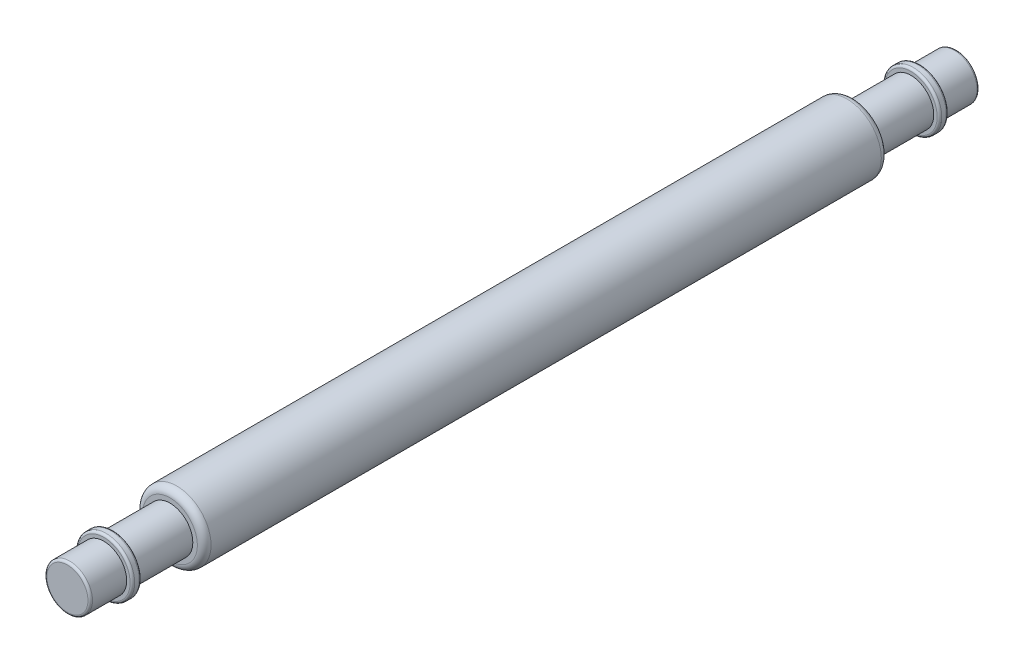
ISO-10303-21;
HEADER;
FILE_DESCRIPTION(('STEP AP214'),'2;1');
FILE_NAME('part.step','',(''),(''),'','','');
FILE_SCHEMA(('AUTOMOTIVE_DESIGN { 1 0 10303 214 1 1 1 1 }'));
ENDSEC;
DATA;
#1=APPLICATION_CONTEXT('core data for automotive mechanical design processes');
#2=APPLICATION_PROTOCOL_DEFINITION('international standard','automotive_design',2000,#1);
#3=PRODUCT_CONTEXT('',#1,'mechanical');
#4=PRODUCT('Part','Part','',(#3));
#5=PRODUCT_RELATED_PRODUCT_CATEGORY('part','',(#4));
#6=PRODUCT_DEFINITION_FORMATION('','',#4);
#7=PRODUCT_DEFINITION_CONTEXT('part definition',#1,'design');
#8=PRODUCT_DEFINITION('design','',#6,#7);
#9=PRODUCT_DEFINITION_SHAPE('','',#8);
#10=(LENGTH_UNIT() NAMED_UNIT(*) SI_UNIT(.MILLI.,.METRE.));
#11=(NAMED_UNIT(*) PLANE_ANGLE_UNIT() SI_UNIT($,.RADIAN.));
#12=(NAMED_UNIT(*) SI_UNIT($,.STERADIAN.) SOLID_ANGLE_UNIT());
#13=UNCERTAINTY_MEASURE_WITH_UNIT(LENGTH_MEASURE(1.E-05),#10,'distance_accuracy_value','');
#14=(GEOMETRIC_REPRESENTATION_CONTEXT(3) GLOBAL_UNCERTAINTY_ASSIGNED_CONTEXT((#13)) GLOBAL_UNIT_ASSIGNED_CONTEXT((#10,
#11,#12)) REPRESENTATION_CONTEXT('',''));
#15=CARTESIAN_POINT('',(0.,0.,0.));
#16=DIRECTION('',(0.,0.,1.));
#17=DIRECTION('',(1.,0.,0.));
#18=AXIS2_PLACEMENT_3D('',#15,#16,#17);
#19=CARTESIAN_POINT('',(0.,0.,9.75));
#20=DIRECTION('',(0.,0.,-1.));
#21=DIRECTION('',(-1.,0.,0.));
#22=AXIS2_PLACEMENT_3D('',#19,#20,#21);
#23=CYLINDRICAL_SURFACE('',#22,0.5);
#24=CARTESIAN_POINT('',(0.,0.,-7.5));
#25=DIRECTION('',(0.,0.,1.));
#26=DIRECTION('',(1.,0.,0.));
#27=AXIS2_PLACEMENT_3D('',#24,#25,#26);
#28=CIRCLE('',#27,0.5);
#29=CARTESIAN_POINT('',(0.5,0.,-7.5));
#30=VERTEX_POINT('',#29);
#31=EDGE_CURVE('E114',#30,#30,#28,.F.);
#32=ORIENTED_EDGE('',*,*,#31,.T.);
#33=EDGE_LOOP('',(#32));
#34=FACE_BOUND('',#33,.T.);
#35=CARTESIAN_POINT('',(0.,0.,-8.75));
#36=DIRECTION('',(0.,0.,-1.));
#37=DIRECTION('',(-1.,0.,0.));
#38=AXIS2_PLACEMENT_3D('',#35,#36,#37);
#39=CIRCLE('',#38,0.5);
#40=CARTESIAN_POINT('',(-0.5,0.,-8.75));
#41=VERTEX_POINT('',#40);
#42=EDGE_CURVE('E55',#41,#41,#39,.T.);
#43=ORIENTED_EDGE('',*,*,#42,.F.);
#44=EDGE_LOOP('',(#43));
#45=FACE_BOUND('',#44,.T.);
#46=ADVANCED_FACE('F35',(#34,#45),#23,.T.);
#47=CARTESIAN_POINT('',(0.,0.,7.5));
#48=DIRECTION('',(0.,0.,1.));
#49=DIRECTION('',(1.,0.,0.));
#50=AXIS2_PLACEMENT_3D('',#47,#48,#49);
#51=CIRCLE('',#50,0.5);
#52=CARTESIAN_POINT('',(0.5,0.,7.5));
#53=VERTEX_POINT('',#52);
#54=EDGE_CURVE('E86',#53,#53,#51,.F.);
#55=ORIENTED_EDGE('',*,*,#54,.F.);
#56=EDGE_LOOP('',(#55));
#57=FACE_BOUND('',#56,.T.);
#58=CARTESIAN_POINT('',(0.,0.,8.75));
#59=DIRECTION('',(0.,0.,1.));
#60=DIRECTION('',(1.,0.,0.));
#61=AXIS2_PLACEMENT_3D('',#58,#59,#60);
#62=CIRCLE('',#61,0.5);
#63=CARTESIAN_POINT('',(0.5,0.,8.75));
#64=VERTEX_POINT('',#63);
#65=EDGE_CURVE('E78',#64,#64,#62,.T.);
#66=ORIENTED_EDGE('',*,*,#65,.F.);
#67=EDGE_LOOP('',(#66));
#68=FACE_BOUND('',#67,.T.);
#69=ADVANCED_FACE('F123',(#57,#68),#23,.T.);
#70=CARTESIAN_POINT('',(0.,0.,7.5));
#71=DIRECTION('',(0.,0.,1.));
#72=DIRECTION('',(1.,0.,0.));
#73=AXIS2_PLACEMENT_3D('',#70,#71,#72);
#74=PLANE('',#73);
#75=CARTESIAN_POINT('',(0.,0.,7.5));
#76=DIRECTION('',(0.,0.,1.));
#77=DIRECTION('',(1.,0.,0.));
#78=AXIS2_PLACEMENT_3D('',#75,#76,#77);
#79=CIRCLE('',#78,0.600000000000001);
#80=CARTESIAN_POINT('',(0.600000000000001,0.,7.5));
#81=VERTEX_POINT('',#80);
#82=EDGE_CURVE('E110',#81,#81,#79,.T.);
#83=ORIENTED_EDGE('',*,*,#82,.T.);
#84=EDGE_LOOP('',(#83));
#85=FACE_BOUND('',#84,.T.);
#86=ORIENTED_EDGE('',*,*,#54,.T.);
#87=EDGE_LOOP('',(#86));
#88=FACE_BOUND('',#87,.T.);
#89=ADVANCED_FACE('F121',(#85,#88),#74,.T.);
#90=CARTESIAN_POINT('',(0.,0.,-7.5));
#91=DIRECTION('',(0.,0.,1.));
#92=DIRECTION('',(1.,0.,0.));
#93=AXIS2_PLACEMENT_3D('',#90,#91,#92);
#94=PLANE('',#93);
#95=CARTESIAN_POINT('',(0.,0.,-7.5));
#96=DIRECTION('',(0.,0.,1.));
#97=DIRECTION('',(1.,0.,0.));
#98=AXIS2_PLACEMENT_3D('',#95,#96,#97);
#99=CIRCLE('',#98,0.600000000000001);
#100=CARTESIAN_POINT('',(0.600000000000001,0.,-7.5));
#101=VERTEX_POINT('',#100);
#102=EDGE_CURVE('E100',#101,#101,#99,.F.);
#103=ORIENTED_EDGE('',*,*,#102,.T.);
#104=EDGE_LOOP('',(#103));
#105=FACE_BOUND('',#104,.T.);
#106=ORIENTED_EDGE('',*,*,#31,.F.);
#107=EDGE_LOOP('',(#106));
#108=FACE_BOUND('',#107,.T.);
#109=ADVANCED_FACE('F216',(#105,#108),#94,.F.);
#110=CARTESIAN_POINT('',(0.,0.,7.5));
#111=DIRECTION('',(0.,0.,-1.));
#112=DIRECTION('',(-1.,0.,0.));
#113=AXIS2_PLACEMENT_3D('',#110,#111,#112);
#114=CYLINDRICAL_SURFACE('',#113,0.750000000000001);
#115=CARTESIAN_POINT('',(0.,0.,7.35));
#116=DIRECTION('',(0.,0.,1.));
#117=DIRECTION('',(1.,0.,0.));
#118=AXIS2_PLACEMENT_3D('',#115,#116,#117);
#119=CIRCLE('',#118,0.750000000000001);
#120=CARTESIAN_POINT('',(0.750000000000001,0.,7.35));
#121=VERTEX_POINT('',#120);
#122=EDGE_CURVE('E103',#121,#121,#119,.F.);
#123=ORIENTED_EDGE('',*,*,#122,.T.);
#124=EDGE_LOOP('',(#123));
#125=FACE_BOUND('',#124,.T.);
#126=CARTESIAN_POINT('',(0.,0.,-7.35));
#127=DIRECTION('',(0.,0.,1.));
#128=DIRECTION('',(1.,0.,0.));
#129=AXIS2_PLACEMENT_3D('',#126,#127,#128);
#130=CIRCLE('',#129,0.750000000000001);
#131=CARTESIAN_POINT('',(0.750000000000001,0.,-7.35));
#132=VERTEX_POINT('',#131);
#133=EDGE_CURVE('E107',#132,#132,#130,.T.);
#134=ORIENTED_EDGE('',*,*,#133,.T.);
#135=EDGE_LOOP('',(#134));
#136=FACE_BOUND('',#135,.T.);
#137=ADVANCED_FACE('F212',(#125,#136),#114,.T.);
#138=CARTESIAN_POINT('',(0.,0.,7.35));
#139=DIRECTION('',(0.,0.,1.));
#140=DIRECTION('',(1.,0.,0.));
#141=AXIS2_PLACEMENT_3D('',#138,#139,#140);
#142=TOROIDAL_SURFACE('',#141,0.600000000000001,0.15);
#143=ORIENTED_EDGE('',*,*,#122,.F.);
#144=EDGE_LOOP('',(#143));
#145=FACE_BOUND('',#144,.T.);
#146=ORIENTED_EDGE('',*,*,#82,.F.);
#147=EDGE_LOOP('',(#146));
#148=FACE_BOUND('',#147,.T.);
#149=ADVANCED_FACE('F143',(#145,#148),#142,.T.);
#150=CARTESIAN_POINT('',(0.,0.,-7.35));
#151=DIRECTION('',(0.,0.,1.));
#152=DIRECTION('',(1.,0.,0.));
#153=AXIS2_PLACEMENT_3D('',#150,#151,#152);
#154=TOROIDAL_SURFACE('',#153,0.600000000000001,0.15);
#155=ORIENTED_EDGE('',*,*,#102,.F.);
#156=EDGE_LOOP('',(#155));
#157=FACE_BOUND('',#156,.T.);
#158=ORIENTED_EDGE('',*,*,#133,.F.);
#159=EDGE_LOOP('',(#158));
#160=FACE_BOUND('',#159,.T.);
#161=ADVANCED_FACE('F133',(#157,#160),#154,.T.);
#162=CARTESIAN_POINT('',(0.,0.,8.75));
#163=DIRECTION('',(0.,0.,1.));
#164=DIRECTION('',(1.,0.,0.));
#165=AXIS2_PLACEMENT_3D('',#162,#163,#164);
#166=PLANE('',#165);
#167=CARTESIAN_POINT('',(0.,0.,8.75));
#168=DIRECTION('',(0.,0.,1.));
#169=DIRECTION('',(1.,0.,0.));
#170=AXIS2_PLACEMENT_3D('',#167,#168,#169);
#171=CIRCLE('',#170,0.575);
#172=CARTESIAN_POINT('',(0.575,0.,8.75));
#173=VERTEX_POINT('',#172);
#174=EDGE_CURVE('E58',#173,#173,#171,.F.);
#175=ORIENTED_EDGE('',*,*,#174,.T.);
#176=EDGE_LOOP('',(#175));
#177=FACE_BOUND('',#176,.T.);
#178=ORIENTED_EDGE('',*,*,#65,.T.);
#179=EDGE_LOOP('',(#178));
#180=FACE_BOUND('',#179,.T.);
#181=ADVANCED_FACE('F130',(#177,#180),#166,.F.);
#182=CARTESIAN_POINT('',(0.,0.,8.95));
#183=DIRECTION('',(0.,0.,1.));
#184=DIRECTION('',(1.,0.,0.));
#185=AXIS2_PLACEMENT_3D('',#182,#183,#184);
#186=PLANE('',#185);
#187=CARTESIAN_POINT('',(0.,0.,8.95));
#188=DIRECTION('',(0.,0.,1.));
#189=DIRECTION('',(1.,0.,0.));
#190=AXIS2_PLACEMENT_3D('',#187,#188,#189);
#191=CIRCLE('',#190,0.575);
#192=CARTESIAN_POINT('',(0.575,0.,8.95));
#193=VERTEX_POINT('',#192);
#194=EDGE_CURVE('E74',#193,#193,#191,.T.);
#195=ORIENTED_EDGE('',*,*,#194,.T.);
#196=EDGE_LOOP('',(#195));
#197=FACE_BOUND('',#196,.T.);
#198=CARTESIAN_POINT('',(0.,0.,8.95));
#199=DIRECTION('',(0.,0.,1.));
#200=DIRECTION('',(1.,0.,0.));
#201=AXIS2_PLACEMENT_3D('',#198,#199,#200);
#202=CIRCLE('',#201,0.5);
#203=CARTESIAN_POINT('',(0.5,0.,8.95));
#204=VERTEX_POINT('',#203);
#205=EDGE_CURVE('E62',#204,#204,#202,.T.);
#206=ORIENTED_EDGE('',*,*,#205,.F.);
#207=EDGE_LOOP('',(#206));
#208=FACE_BOUND('',#207,.T.);
#209=ADVANCED_FACE('F132',(#197,#208),#186,.T.);
#210=CARTESIAN_POINT('',(0.,0.,8.75));
#211=DIRECTION('',(0.,0.,1.));
#212=DIRECTION('',(1.,0.,0.));
#213=AXIS2_PLACEMENT_3D('',#210,#211,#212);
#214=CYLINDRICAL_SURFACE('',#213,0.625);
#215=CARTESIAN_POINT('',(0.,0.,8.9));
#216=DIRECTION('',(0.,0.,1.));
#217=DIRECTION('',(1.,0.,0.));
#218=AXIS2_PLACEMENT_3D('',#215,#216,#217);
#219=CIRCLE('',#218,0.625);
#220=CARTESIAN_POINT('',(0.625,0.,8.9));
#221=VERTEX_POINT('',#220);
#222=EDGE_CURVE('E66',#221,#221,#219,.F.);
#223=ORIENTED_EDGE('',*,*,#222,.T.);
#224=EDGE_LOOP('',(#223));
#225=FACE_BOUND('',#224,.T.);
#226=CARTESIAN_POINT('',(0.,0.,8.8));
#227=DIRECTION('',(0.,0.,1.));
#228=DIRECTION('',(1.,0.,0.));
#229=AXIS2_PLACEMENT_3D('',#226,#227,#228);
#230=CIRCLE('',#229,0.625);
#231=CARTESIAN_POINT('',(0.625,0.,8.8));
#232=VERTEX_POINT('',#231);
#233=EDGE_CURVE('E70',#232,#232,#230,.T.);
#234=ORIENTED_EDGE('',*,*,#233,.T.);
#235=EDGE_LOOP('',(#234));
#236=FACE_BOUND('',#235,.T.);
#237=ADVANCED_FACE('F140',(#225,#236),#214,.T.);
#238=CARTESIAN_POINT('',(0.,0.,9.75));
#239=DIRECTION('',(0.,0.,1.));
#240=DIRECTION('',(1.,0.,0.));
#241=AXIS2_PLACEMENT_3D('',#238,#239,#240);
#242=PLANE('',#241);
#243=CARTESIAN_POINT('',(0.,0.,9.75));
#244=DIRECTION('',(0.,0.,1.));
#245=DIRECTION('',(1.,0.,0.));
#246=AXIS2_PLACEMENT_3D('',#243,#244,#245);
#247=CIRCLE('',#246,0.45);
#248=CARTESIAN_POINT('',(0.45,0.,9.75));
#249=VERTEX_POINT('',#248);
#250=EDGE_CURVE('E96',#249,#249,#247,.T.);
#251=ORIENTED_EDGE('',*,*,#250,.T.);
#252=EDGE_LOOP('',(#251));
#253=FACE_BOUND('',#252,.T.);
#254=ADVANCED_FACE('F166',(#253),#242,.T.);
#255=CARTESIAN_POINT('',(0.,0.,9.7));
#256=DIRECTION('',(0.,0.,1.));
#257=DIRECTION('',(1.,0.,0.));
#258=AXIS2_PLACEMENT_3D('',#255,#256,#257);
#259=TOROIDAL_SURFACE('',#258,0.45,0.05);
#260=CARTESIAN_POINT('',(0.,0.,9.7));
#261=DIRECTION('',(0.,0.,1.));
#262=DIRECTION('',(1.,0.,0.));
#263=AXIS2_PLACEMENT_3D('',#260,#261,#262);
#264=CIRCLE('',#263,0.5);
#265=CARTESIAN_POINT('',(0.5,0.,9.7));
#266=VERTEX_POINT('',#265);
#267=EDGE_CURVE('E92',#266,#266,#264,.F.);
#268=ORIENTED_EDGE('',*,*,#267,.F.);
#269=EDGE_LOOP('',(#268));
#270=FACE_BOUND('',#269,.T.);
#271=ORIENTED_EDGE('',*,*,#250,.F.);
#272=EDGE_LOOP('',(#271));
#273=FACE_BOUND('',#272,.T.);
#274=ADVANCED_FACE('F157',(#270,#273),#259,.T.);
#275=ORIENTED_EDGE('',*,*,#205,.T.);
#276=EDGE_LOOP('',(#275));
#277=FACE_BOUND('',#276,.T.);
#278=ORIENTED_EDGE('',*,*,#267,.T.);
#279=EDGE_LOOP('',(#278));
#280=FACE_BOUND('',#279,.T.);
#281=ADVANCED_FACE('F149',(#277,#280),#23,.T.);
#282=CARTESIAN_POINT('',(0.,0.,8.9));
#283=DIRECTION('',(0.,0.,1.));
#284=DIRECTION('',(1.,0.,0.));
#285=AXIS2_PLACEMENT_3D('',#282,#283,#284);
#286=TOROIDAL_SURFACE('',#285,0.575,0.05);
#287=ORIENTED_EDGE('',*,*,#222,.F.);
#288=EDGE_LOOP('',(#287));
#289=FACE_BOUND('',#288,.T.);
#290=ORIENTED_EDGE('',*,*,#194,.F.);
#291=EDGE_LOOP('',(#290));
#292=FACE_BOUND('',#291,.T.);
#293=ADVANCED_FACE('F156',(#289,#292),#286,.T.);
#294=CARTESIAN_POINT('',(0.,0.,8.8));
#295=DIRECTION('',(0.,0.,1.));
#296=DIRECTION('',(1.,0.,0.));
#297=AXIS2_PLACEMENT_3D('',#294,#295,#296);
#298=TOROIDAL_SURFACE('',#297,0.575,0.05);
#299=ORIENTED_EDGE('',*,*,#174,.F.);
#300=EDGE_LOOP('',(#299));
#301=FACE_BOUND('',#300,.T.);
#302=ORIENTED_EDGE('',*,*,#233,.F.);
#303=EDGE_LOOP('',(#302));
#304=FACE_BOUND('',#303,.T.);
#305=ADVANCED_FACE('F163',(#301,#304),#298,.T.);
#306=CARTESIAN_POINT('',(0.,0.,-8.75));
#307=DIRECTION('',(0.,0.,-1.));
#308=DIRECTION('',(1.,0.,0.));
#309=AXIS2_PLACEMENT_3D('',#306,#307,#308);
#310=PLANE('',#309);
#311=CARTESIAN_POINT('',(0.,0.,-8.75));
#312=DIRECTION('',(0.,0.,-1.));
#313=DIRECTION('',(-1.,0.,0.));
#314=AXIS2_PLACEMENT_3D('',#311,#312,#313);
#315=CIRCLE('',#314,0.575);
#316=CARTESIAN_POINT('',(-0.575,0.,-8.75));
#317=VERTEX_POINT('',#316);
#318=EDGE_CURVE('E10',#317,#317,#315,.F.);
#319=ORIENTED_EDGE('',*,*,#318,.T.);
#320=EDGE_LOOP('',(#319));
#321=FACE_BOUND('',#320,.T.);
#322=ORIENTED_EDGE('',*,*,#42,.T.);
#323=EDGE_LOOP('',(#322));
#324=FACE_BOUND('',#323,.T.);
#325=ADVANCED_FACE('F190',(#321,#324),#310,.F.);
#326=CARTESIAN_POINT('',(0.,0.,-8.95));
#327=DIRECTION('',(0.,0.,-1.));
#328=DIRECTION('',(1.,0.,0.));
#329=AXIS2_PLACEMENT_3D('',#326,#327,#328);
#330=PLANE('',#329);
#331=CARTESIAN_POINT('',(0.,0.,-8.95));
#332=DIRECTION('',(0.,0.,-1.));
#333=DIRECTION('',(-1.,0.,0.));
#334=AXIS2_PLACEMENT_3D('',#331,#332,#333);
#335=CIRCLE('',#334,0.575);
#336=CARTESIAN_POINT('',(-0.575,0.,-8.95));
#337=VERTEX_POINT('',#336);
#338=EDGE_CURVE('E42',#337,#337,#335,.T.);
#339=ORIENTED_EDGE('',*,*,#338,.T.);
#340=EDGE_LOOP('',(#339));
#341=FACE_BOUND('',#340,.T.);
#342=CARTESIAN_POINT('',(0.,0.,-8.95));
#343=DIRECTION('',(0.,0.,-1.));
#344=DIRECTION('',(-1.,0.,0.));
#345=AXIS2_PLACEMENT_3D('',#342,#343,#344);
#346=CIRCLE('',#345,0.5);
#347=CARTESIAN_POINT('',(-0.5,0.,-8.95));
#348=VERTEX_POINT('',#347);
#349=EDGE_CURVE('E59',#348,#348,#346,.T.);
#350=ORIENTED_EDGE('',*,*,#349,.F.);
#351=EDGE_LOOP('',(#350));
#352=FACE_BOUND('',#351,.T.);
#353=ADVANCED_FACE('F187',(#341,#352),#330,.T.);
#354=CARTESIAN_POINT('',(0.,0.,-8.75));
#355=DIRECTION('',(0.,0.,-1.));
#356=DIRECTION('',(-1.,0.,0.));
#357=AXIS2_PLACEMENT_3D('',#354,#355,#356);
#358=CYLINDRICAL_SURFACE('',#357,0.625);
#359=CARTESIAN_POINT('',(0.,0.,-8.9));
#360=DIRECTION('',(0.,0.,-1.));
#361=DIRECTION('',(-1.,0.,0.));
#362=AXIS2_PLACEMENT_3D('',#359,#360,#361);
#363=CIRCLE('',#362,0.625);
#364=CARTESIAN_POINT('',(-0.625,0.,-8.9));
#365=VERTEX_POINT('',#364);
#366=EDGE_CURVE('E46',#365,#365,#363,.F.);
#367=ORIENTED_EDGE('',*,*,#366,.T.);
#368=EDGE_LOOP('',(#367));
#369=FACE_BOUND('',#368,.T.);
#370=CARTESIAN_POINT('',(0.,0.,-8.8));
#371=DIRECTION('',(0.,0.,-1.));
#372=DIRECTION('',(-1.,0.,0.));
#373=AXIS2_PLACEMENT_3D('',#370,#371,#372);
#374=CIRCLE('',#373,0.625);
#375=CARTESIAN_POINT('',(-0.625,0.,-8.8));
#376=VERTEX_POINT('',#375);
#377=EDGE_CURVE('E50',#376,#376,#374,.T.);
#378=ORIENTED_EDGE('',*,*,#377,.T.);
#379=EDGE_LOOP('',(#378));
#380=FACE_BOUND('',#379,.T.);
#381=ADVANCED_FACE('F189',(#369,#380),#358,.T.);
#382=CARTESIAN_POINT('',(0.,0.,-9.75));
#383=DIRECTION('',(0.,0.,1.));
#384=DIRECTION('',(1.,0.,0.));
#385=AXIS2_PLACEMENT_3D('',#382,#383,#384);
#386=PLANE('',#385);
#387=CARTESIAN_POINT('',(0.,0.,-9.75));
#388=DIRECTION('',(0.,0.,1.));
#389=DIRECTION('',(1.,0.,0.));
#390=AXIS2_PLACEMENT_3D('',#387,#388,#389);
#391=CIRCLE('',#390,0.45);
#392=CARTESIAN_POINT('',(0.45,0.,-9.75));
#393=VERTEX_POINT('',#392);
#394=EDGE_CURVE('E82',#393,#393,#391,.F.);
#395=ORIENTED_EDGE('',*,*,#394,.T.);
#396=EDGE_LOOP('',(#395));
#397=FACE_BOUND('',#396,.T.);
#398=ADVANCED_FACE('F179',(#397),#386,.F.);
#399=CARTESIAN_POINT('',(0.,0.,-9.7));
#400=DIRECTION('',(0.,0.,1.));
#401=DIRECTION('',(1.,0.,0.));
#402=AXIS2_PLACEMENT_3D('',#399,#400,#401);
#403=TOROIDAL_SURFACE('',#402,0.45,0.05);
#404=ORIENTED_EDGE('',*,*,#394,.F.);
#405=EDGE_LOOP('',(#404));
#406=FACE_BOUND('',#405,.T.);
#407=CARTESIAN_POINT('',(0.,0.,-9.7));
#408=DIRECTION('',(0.,0.,1.));
#409=DIRECTION('',(1.,0.,0.));
#410=AXIS2_PLACEMENT_3D('',#407,#408,#409);
#411=CIRCLE('',#410,0.5);
#412=CARTESIAN_POINT('',(0.5,0.,-9.7));
#413=VERTEX_POINT('',#412);
#414=EDGE_CURVE('E89',#413,#413,#411,.T.);
#415=ORIENTED_EDGE('',*,*,#414,.F.);
#416=EDGE_LOOP('',(#415));
#417=FACE_BOUND('',#416,.T.);
#418=ADVANCED_FACE('F172',(#406,#417),#403,.T.);
#419=ORIENTED_EDGE('',*,*,#349,.T.);
#420=EDGE_LOOP('',(#419));
#421=FACE_BOUND('',#420,.T.);
#422=ORIENTED_EDGE('',*,*,#414,.T.);
#423=EDGE_LOOP('',(#422));
#424=FACE_BOUND('',#423,.T.);
#425=ADVANCED_FACE('F127',(#421,#424),#23,.T.);
#426=CARTESIAN_POINT('',(0.,0.,-8.9));
#427=DIRECTION('',(0.,0.,-1.));
#428=DIRECTION('',(-1.,0.,0.));
#429=AXIS2_PLACEMENT_3D('',#426,#427,#428);
#430=TOROIDAL_SURFACE('',#429,0.575,0.05);
#431=ORIENTED_EDGE('',*,*,#338,.F.);
#432=EDGE_LOOP('',(#431));
#433=FACE_BOUND('',#432,.T.);
#434=ORIENTED_EDGE('',*,*,#366,.F.);
#435=EDGE_LOOP('',(#434));
#436=FACE_BOUND('',#435,.T.);
#437=ADVANCED_FACE('F171',(#433,#436),#430,.T.);
#438=CARTESIAN_POINT('',(0.,0.,-8.8));
#439=DIRECTION('',(0.,0.,-1.));
#440=DIRECTION('',(-1.,0.,0.));
#441=AXIS2_PLACEMENT_3D('',#438,#439,#440);
#442=TOROIDAL_SURFACE('',#441,0.575,0.05);
#443=ORIENTED_EDGE('',*,*,#377,.F.);
#444=EDGE_LOOP('',(#443));
#445=FACE_BOUND('',#444,.T.);
#446=ORIENTED_EDGE('',*,*,#318,.F.);
#447=EDGE_LOOP('',(#446));
#448=FACE_BOUND('',#447,.T.);
#449=ADVANCED_FACE('F37',(#445,#448),#442,.T.);
#450=CLOSED_SHELL('',(#46,#69,#89,#109,#137,#149,#161,#181,#209,#237,#254,#274,#281,#293,#305,
#325,#353,#381,#398,#418,#425,#437,#449));
#451=MANIFOLD_SOLID_BREP('B2',#450);
#452=ADVANCED_BREP_SHAPE_REPRESENTATION('',(#18,#451),#14);
#453=SHAPE_DEFINITION_REPRESENTATION(#9,#452);
ENDSEC;
END-ISO-10303-21;
